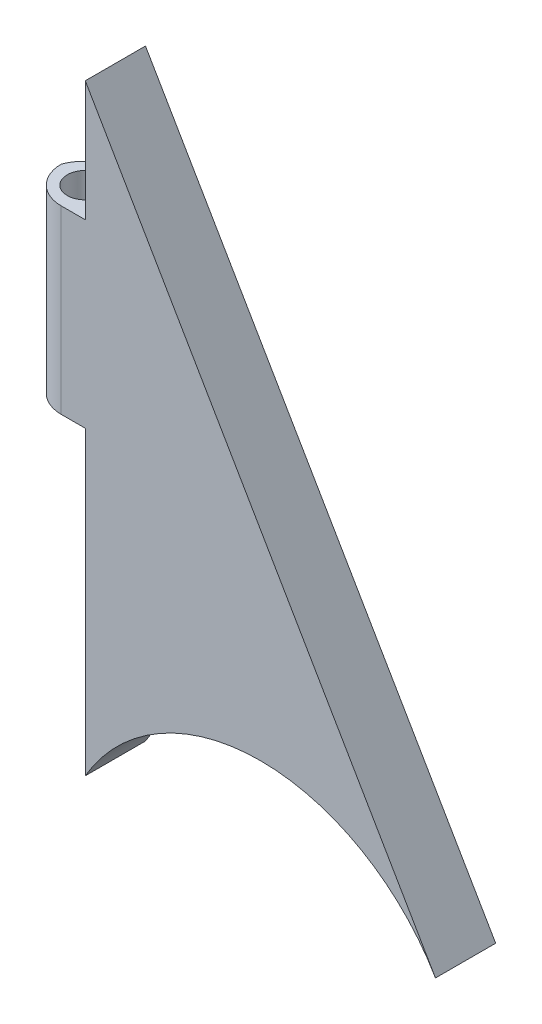
ISO-10303-21;
HEADER;
FILE_DESCRIPTION(('STEP AP214'),'2;1');
FILE_NAME('part.step','',(''),(''),'','','');
FILE_SCHEMA(('AUTOMOTIVE_DESIGN { 1 0 10303 214 1 1 1 1 }'));
ENDSEC;
DATA;
#1=APPLICATION_CONTEXT('core data for automotive mechanical design processes');
#2=APPLICATION_PROTOCOL_DEFINITION('international standard','automotive_design',2000,#1);
#3=PRODUCT_CONTEXT('',#1,'mechanical');
#4=PRODUCT('Part','Part','',(#3));
#5=PRODUCT_RELATED_PRODUCT_CATEGORY('part','',(#4));
#6=PRODUCT_DEFINITION_FORMATION('','',#4);
#7=PRODUCT_DEFINITION_CONTEXT('part definition',#1,'design');
#8=PRODUCT_DEFINITION('design','',#6,#7);
#9=PRODUCT_DEFINITION_SHAPE('','',#8);
#10=(LENGTH_UNIT() NAMED_UNIT(*) SI_UNIT(.MILLI.,.METRE.));
#11=(NAMED_UNIT(*) PLANE_ANGLE_UNIT() SI_UNIT($,.RADIAN.));
#12=(NAMED_UNIT(*) SI_UNIT($,.STERADIAN.) SOLID_ANGLE_UNIT());
#13=UNCERTAINTY_MEASURE_WITH_UNIT(LENGTH_MEASURE(1.E-05),#10,'distance_accuracy_value','');
#14=(GEOMETRIC_REPRESENTATION_CONTEXT(3) GLOBAL_UNCERTAINTY_ASSIGNED_CONTEXT((#13)) GLOBAL_UNIT_ASSIGNED_CONTEXT((#10,
#11,#12)) REPRESENTATION_CONTEXT('',''));
#15=CARTESIAN_POINT('',(0.,0.,0.));
#16=DIRECTION('',(0.,0.,1.));
#17=DIRECTION('',(1.,0.,0.));
#18=AXIS2_PLACEMENT_3D('',#15,#16,#17);
#19=CARTESIAN_POINT('',(0.,0.,-5.));
#20=DIRECTION('',(-1.,0.,0.));
#21=DIRECTION('',(0.,0.,-1.));
#22=AXIS2_PLACEMENT_3D('',#19,#20,#21);
#23=PLANE('',#22);
#24=DIRECTION('',(0.,1.,0.));
#25=VECTOR('',#24,1.);
#26=CARTESIAN_POINT('',(0.,0.,-5.));
#27=LINE('',#26,#25);
#28=CARTESIAN_POINT('',(0.,0.,-5.));
#29=VERTEX_POINT('',#28);
#30=CARTESIAN_POINT('',(0.,25.,-5.));
#31=VERTEX_POINT('',#30);
#32=EDGE_CURVE('E143',#29,#31,#27,.T.);
#33=ORIENTED_EDGE('',*,*,#32,.F.);
#34=DIRECTION('',(0.,0.,1.));
#35=VECTOR('',#34,1.);
#36=CARTESIAN_POINT('',(0.,0.,-5.));
#37=LINE('',#36,#35);
#38=CARTESIAN_POINT('',(0.,0.,0.));
#39=VERTEX_POINT('',#38);
#40=EDGE_CURVE('E148',#29,#39,#37,.T.);
#41=ORIENTED_EDGE('',*,*,#40,.T.);
#42=DIRECTION('',(0.,1.,0.));
#43=VECTOR('',#42,1.);
#44=CARTESIAN_POINT('',(0.,0.,0.));
#45=LINE('',#44,#43);
#46=CARTESIAN_POINT('',(0.,25.,0.));
#47=VERTEX_POINT('',#46);
#48=EDGE_CURVE('E120',#39,#47,#45,.T.);
#49=ORIENTED_EDGE('',*,*,#48,.T.);
#50=DIRECTION('',(0.,0.,1.));
#51=VECTOR('',#50,1.);
#52=CARTESIAN_POINT('',(0.,25.,0.));
#53=LINE('',#52,#51);
#54=EDGE_CURVE('E135',#31,#47,#53,.T.);
#55=ORIENTED_EDGE('',*,*,#54,.F.);
#56=EDGE_LOOP('',(#33,#41,#49,#55));
#57=FACE_BOUND('',#56,.T.);
#58=ADVANCED_FACE('F35',(#57),#23,.T.);
#59=CARTESIAN_POINT('',(14.5441389290883,-8.46127908754482,-5.));
#60=DIRECTION('',(0.,0.,1.));
#61=DIRECTION('',(-1.,0.,0.));
#62=AXIS2_PLACEMENT_3D('',#59,#60,#61);
#63=CYLINDRICAL_SURFACE('',#62,16.8263252371379);
#64=CARTESIAN_POINT('',(14.5441389290883,-8.46127908754482,0.));
#65=DIRECTION('',(0.,0.,1.));
#66=DIRECTION('',(1.,0.,0.));
#67=AXIS2_PLACEMENT_3D('',#64,#65,#66);
#68=CIRCLE('',#67,16.8263252371379);
#69=CARTESIAN_POINT('',(29.0882778581765,0.,0.));
#70=VERTEX_POINT('',#69);
#71=EDGE_CURVE('E121',#70,#39,#68,.T.);
#72=ORIENTED_EDGE('',*,*,#71,.T.);
#73=ORIENTED_EDGE('',*,*,#40,.F.);
#74=CARTESIAN_POINT('',(14.5441389290883,-8.46127908754482,-5.));
#75=DIRECTION('',(0.,0.,1.));
#76=DIRECTION('',(1.,0.,0.));
#77=AXIS2_PLACEMENT_3D('',#74,#75,#76);
#78=CIRCLE('',#77,16.8263252371379);
#79=CARTESIAN_POINT('',(29.0882778581765,0.,-5.));
#80=VERTEX_POINT('',#79);
#81=EDGE_CURVE('E141',#80,#29,#78,.T.);
#82=ORIENTED_EDGE('',*,*,#81,.F.);
#83=DIRECTION('',(0.,0.,1.));
#84=VECTOR('',#83,1.);
#85=CARTESIAN_POINT('',(29.0882778581765,0.,-5.));
#86=LINE('',#85,#84);
#87=EDGE_CURVE('E152',#80,#70,#86,.T.);
#88=ORIENTED_EDGE('',*,*,#87,.T.);
#89=EDGE_LOOP('',(#72,#73,#82,#88));
#90=FACE_BOUND('',#89,.T.);
#91=ADVANCED_FACE('F179',(#90),#63,.F.);
#92=CARTESIAN_POINT('',(0.,50.,-5.));
#93=DIRECTION('',(0.864368109145272,0.502859594611286,0.));
#94=DIRECTION('',(-0.502859594611286,0.864368109145272,0.));
#95=AXIS2_PLACEMENT_3D('',#92,#93,#94);
#96=PLANE('',#95);
#97=DIRECTION('',(0.502859594611286,-0.864368109145272,0.));
#98=VECTOR('',#97,1.);
#99=CARTESIAN_POINT('',(0.,50.,0.));
#100=LINE('',#99,#98);
#101=CARTESIAN_POINT('',(0.,50.,0.));
#102=VERTEX_POINT('',#101);
#103=EDGE_CURVE('E116',#102,#70,#100,.T.);
#104=ORIENTED_EDGE('',*,*,#103,.T.);
#105=ORIENTED_EDGE('',*,*,#87,.F.);
#106=DIRECTION('',(0.502859594611286,-0.864368109145272,0.));
#107=VECTOR('',#106,1.);
#108=CARTESIAN_POINT('',(0.,50.,-5.));
#109=LINE('',#108,#107);
#110=CARTESIAN_POINT('',(0.,50.,-5.));
#111=VERTEX_POINT('',#110);
#112=EDGE_CURVE('E146',#111,#80,#109,.T.);
#113=ORIENTED_EDGE('',*,*,#112,.F.);
#114=DIRECTION('',(0.,0.,1.));
#115=VECTOR('',#114,1.);
#116=CARTESIAN_POINT('',(0.,50.,-5.));
#117=LINE('',#116,#115);
#118=EDGE_CURVE('E156',#111,#102,#117,.T.);
#119=ORIENTED_EDGE('',*,*,#118,.T.);
#120=EDGE_LOOP('',(#104,#105,#113,#119));
#121=FACE_BOUND('',#120,.T.);
#122=ADVANCED_FACE('F183',(#121),#96,.T.);
#123=DIRECTION('',(0.,0.,1.));
#124=VECTOR('',#123,1.);
#125=CARTESIAN_POINT('',(0.,40.,0.));
#126=LINE('',#125,#124);
#127=CARTESIAN_POINT('',(0.,40.,-5.));
#128=VERTEX_POINT('',#127);
#129=CARTESIAN_POINT('',(0.,40.,0.));
#130=VERTEX_POINT('',#129);
#131=EDGE_CURVE('E104',#128,#130,#126,.T.);
#132=ORIENTED_EDGE('',*,*,#131,.T.);
#133=EDGE_CURVE('E113',#130,#102,#45,.T.);
#134=ORIENTED_EDGE('',*,*,#133,.T.);
#135=ORIENTED_EDGE('',*,*,#118,.F.);
#136=EDGE_CURVE('E125',#128,#111,#27,.T.);
#137=ORIENTED_EDGE('',*,*,#136,.F.);
#138=EDGE_LOOP('',(#132,#134,#135,#137));
#139=FACE_BOUND('',#138,.T.);
#140=ADVANCED_FACE('F124',(#139),#23,.T.);
#141=CARTESIAN_POINT('',(14.5441389290883,-8.46127908754482,-5.));
#142=DIRECTION('',(0.,0.,-1.));
#143=DIRECTION('',(1.,0.,0.));
#144=AXIS2_PLACEMENT_3D('',#141,#142,#143);
#145=PLANE('',#144);
#146=DIRECTION('',(1.,0.,0.));
#147=VECTOR('',#146,1.);
#148=CARTESIAN_POINT('',(0.,40.,-5.));
#149=LINE('',#148,#147);
#150=CARTESIAN_POINT('',(-2.17157287525381,40.,-5.));
#151=VERTEX_POINT('',#150);
#152=EDGE_CURVE('E110',#151,#128,#149,.T.);
#153=ORIENTED_EDGE('',*,*,#152,.T.);
#154=ORIENTED_EDGE('',*,*,#136,.T.);
#155=ORIENTED_EDGE('',*,*,#112,.T.);
#156=ORIENTED_EDGE('',*,*,#81,.T.);
#157=ORIENTED_EDGE('',*,*,#32,.T.);
#158=DIRECTION('',(1.,0.,0.));
#159=VECTOR('',#158,1.);
#160=CARTESIAN_POINT('',(0.,25.,-5.));
#161=LINE('',#160,#159);
#162=CARTESIAN_POINT('',(-2.17157287525381,25.,-5.));
#163=VERTEX_POINT('',#162);
#164=EDGE_CURVE('E126',#163,#31,#161,.T.);
#165=ORIENTED_EDGE('',*,*,#164,.F.);
#166=DIRECTION('',(0.,1.,0.));
#167=VECTOR('',#166,1.);
#168=CARTESIAN_POINT('',(-2.17157287525381,25.,-5.));
#169=LINE('',#168,#167);
#170=EDGE_CURVE('E166',#151,#163,#169,.F.);
#171=ORIENTED_EDGE('',*,*,#170,.F.);
#172=EDGE_LOOP('',(#153,#154,#155,#156,#157,#165,#171));
#173=FACE_BOUND('',#172,.T.);
#174=ADVANCED_FACE('F185',(#173),#145,.T.);
#175=CARTESIAN_POINT('',(14.5441389290883,-8.46127908754482,0.));
#176=DIRECTION('',(0.,0.,-1.));
#177=DIRECTION('',(1.,0.,0.));
#178=AXIS2_PLACEMENT_3D('',#175,#176,#177);
#179=PLANE('',#178);
#180=DIRECTION('',(-1.,0.,0.));
#181=VECTOR('',#180,1.);
#182=CARTESIAN_POINT('',(0.,25.,0.));
#183=LINE('',#182,#181);
#184=CARTESIAN_POINT('',(-2.,25.,0.));
#185=VERTEX_POINT('',#184);
#186=EDGE_CURVE('E128',#47,#185,#183,.T.);
#187=ORIENTED_EDGE('',*,*,#186,.F.);
#188=ORIENTED_EDGE('',*,*,#48,.F.);
#189=ORIENTED_EDGE('',*,*,#71,.F.);
#190=ORIENTED_EDGE('',*,*,#103,.F.);
#191=ORIENTED_EDGE('',*,*,#133,.F.);
#192=DIRECTION('',(-1.,0.,0.));
#193=VECTOR('',#192,1.);
#194=CARTESIAN_POINT('',(0.,40.,0.));
#195=LINE('',#194,#193);
#196=CARTESIAN_POINT('',(-2.,40.,0.));
#197=VERTEX_POINT('',#196);
#198=EDGE_CURVE('E98',#130,#197,#195,.T.);
#199=ORIENTED_EDGE('',*,*,#198,.T.);
#200=DIRECTION('',(0.,-1.,0.));
#201=VECTOR('',#200,1.);
#202=CARTESIAN_POINT('',(-2.,-8.46127908754482,0.));
#203=LINE('',#202,#201);
#204=EDGE_CURVE('E163',#185,#197,#203,.F.);
#205=ORIENTED_EDGE('',*,*,#204,.F.);
#206=EDGE_LOOP('',(#187,#188,#189,#190,#191,#199,#205));
#207=FACE_BOUND('',#206,.T.);
#208=ADVANCED_FACE('F114',(#207),#179,.F.);
#209=CARTESIAN_POINT('',(0.,40.,0.));
#210=DIRECTION('',(0.,-1.,0.));
#211=DIRECTION('',(0.,0.,1.));
#212=AXIS2_PLACEMENT_3D('',#209,#210,#211);
#213=PLANE('',#212);
#214=CARTESIAN_POINT('',(-2.,40.,-3.));
#215=DIRECTION('',(0.,1.,0.));
#216=DIRECTION('',(0.,0.,1.));
#217=AXIS2_PLACEMENT_3D('',#214,#215,#216);
#218=CIRCLE('',#217,3.);
#219=CARTESIAN_POINT('',(-5.,40.,-3.));
#220=VERTEX_POINT('',#219);
#221=EDGE_CURVE('E106',#197,#220,#218,.F.);
#222=ORIENTED_EDGE('',*,*,#221,.F.);
#223=ORIENTED_EDGE('',*,*,#198,.F.);
#224=ORIENTED_EDGE('',*,*,#131,.F.);
#225=ORIENTED_EDGE('',*,*,#152,.F.);
#226=CARTESIAN_POINT('',(-2.17157287525381,40.,-2.));
#227=DIRECTION('',(0.,1.,0.));
#228=DIRECTION('',(0.,0.,1.));
#229=AXIS2_PLACEMENT_3D('',#226,#227,#228);
#230=CIRCLE('',#229,3.);
#231=EDGE_CURVE('E11',#220,#151,#230,.F.);
#232=ORIENTED_EDGE('',*,*,#231,.F.);
#233=EDGE_LOOP('',(#222,#223,#224,#225,#232));
#234=FACE_BOUND('',#233,.T.);
#235=CARTESIAN_POINT('',(-2.48600518446587,40.,-2.49117230230951));
#236=DIRECTION('',(0.,-1.,0.));
#237=DIRECTION('',(0.,0.,-1.));
#238=AXIS2_PLACEMENT_3D('',#235,#236,#237);
#239=CIRCLE('',#238,1.5);
#240=CARTESIAN_POINT('',(-2.48600518446587,40.,-3.99117230230951));
#241=VERTEX_POINT('',#240);
#242=EDGE_CURVE('E138',#241,#241,#239,.T.);
#243=ORIENTED_EDGE('',*,*,#242,.T.);
#244=EDGE_LOOP('',(#243));
#245=FACE_BOUND('',#244,.T.);
#246=ADVANCED_FACE('F100',(#234,#245),#213,.F.);
#247=CARTESIAN_POINT('',(0.,25.,0.));
#248=DIRECTION('',(0.,-1.,0.));
#249=DIRECTION('',(0.,0.,1.));
#250=AXIS2_PLACEMENT_3D('',#247,#248,#249);
#251=PLANE('',#250);
#252=ORIENTED_EDGE('',*,*,#164,.T.);
#253=ORIENTED_EDGE('',*,*,#54,.T.);
#254=ORIENTED_EDGE('',*,*,#186,.T.);
#255=CARTESIAN_POINT('',(-2.,25.,-3.));
#256=DIRECTION('',(0.,1.,0.));
#257=DIRECTION('',(0.,0.,1.));
#258=AXIS2_PLACEMENT_3D('',#255,#256,#257);
#259=CIRCLE('',#258,3.);
#260=CARTESIAN_POINT('',(-5.,25.,-3.));
#261=VERTEX_POINT('',#260);
#262=EDGE_CURVE('E161',#261,#185,#259,.T.);
#263=ORIENTED_EDGE('',*,*,#262,.F.);
#264=CARTESIAN_POINT('',(-2.17157287525381,25.,-2.));
#265=DIRECTION('',(0.,1.,0.));
#266=DIRECTION('',(0.,0.,1.));
#267=AXIS2_PLACEMENT_3D('',#264,#265,#266);
#268=CIRCLE('',#267,3.);
#269=EDGE_CURVE('E43',#163,#261,#268,.T.);
#270=ORIENTED_EDGE('',*,*,#269,.F.);
#271=EDGE_LOOP('',(#252,#253,#254,#263,#270));
#272=FACE_BOUND('',#271,.T.);
#273=CARTESIAN_POINT('',(-2.48600518446587,25.,-2.49117230230951));
#274=DIRECTION('',(0.,-1.,0.));
#275=DIRECTION('',(0.,0.,-1.));
#276=AXIS2_PLACEMENT_3D('',#273,#274,#275);
#277=CIRCLE('',#276,1.5);
#278=CARTESIAN_POINT('',(-2.48600518446587,25.,-3.99117230230951));
#279=VERTEX_POINT('',#278);
#280=EDGE_CURVE('E131',#279,#279,#277,.T.);
#281=ORIENTED_EDGE('',*,*,#280,.F.);
#282=EDGE_LOOP('',(#281));
#283=FACE_BOUND('',#282,.T.);
#284=ADVANCED_FACE('F168',(#272,#283),#251,.T.);
#285=CARTESIAN_POINT('',(-2.48600518446587,40.,-2.49117230230951));
#286=DIRECTION('',(0.,-1.,0.));
#287=DIRECTION('',(0.,0.,1.));
#288=AXIS2_PLACEMENT_3D('',#285,#286,#287);
#289=CYLINDRICAL_SURFACE('',#288,1.5);
#290=ORIENTED_EDGE('',*,*,#242,.F.);
#291=EDGE_LOOP('',(#290));
#292=FACE_BOUND('',#291,.T.);
#293=ORIENTED_EDGE('',*,*,#280,.T.);
#294=EDGE_LOOP('',(#293));
#295=FACE_BOUND('',#294,.T.);
#296=ADVANCED_FACE('F202',(#292,#295),#289,.F.);
#297=CARTESIAN_POINT('',(-2.,40.,-3.));
#298=DIRECTION('',(0.,-1.,0.));
#299=DIRECTION('',(0.,0.,1.));
#300=AXIS2_PLACEMENT_3D('',#297,#298,#299);
#301=CYLINDRICAL_SURFACE('',#300,3.);
#302=ORIENTED_EDGE('',*,*,#221,.T.);
#303=DIRECTION('',(0.,-1.,0.));
#304=VECTOR('',#303,1.);
#305=CARTESIAN_POINT('',(-5.,40.,-3.));
#306=LINE('',#305,#304);
#307=EDGE_CURVE('E155',#220,#261,#306,.T.);
#308=ORIENTED_EDGE('',*,*,#307,.T.);
#309=ORIENTED_EDGE('',*,*,#262,.T.);
#310=ORIENTED_EDGE('',*,*,#204,.T.);
#311=EDGE_LOOP('',(#302,#308,#309,#310));
#312=FACE_BOUND('',#311,.T.);
#313=ADVANCED_FACE('F171',(#312),#301,.T.);
#314=CARTESIAN_POINT('',(-2.17157287525381,40.,-2.));
#315=DIRECTION('',(0.,-1.,0.));
#316=DIRECTION('',(0.,0.,1.));
#317=AXIS2_PLACEMENT_3D('',#314,#315,#316);
#318=CYLINDRICAL_SURFACE('',#317,3.);
#319=ORIENTED_EDGE('',*,*,#231,.T.);
#320=ORIENTED_EDGE('',*,*,#170,.T.);
#321=ORIENTED_EDGE('',*,*,#269,.T.);
#322=ORIENTED_EDGE('',*,*,#307,.F.);
#323=EDGE_LOOP('',(#319,#320,#321,#322));
#324=FACE_BOUND('',#323,.T.);
#325=ADVANCED_FACE('F37',(#324),#318,.T.);
#326=CLOSED_SHELL('',(#58,#91,#122,#140,#174,#208,#246,#284,#296,#313,#325));
#327=MANIFOLD_SOLID_BREP('B2',#326);
#328=ADVANCED_BREP_SHAPE_REPRESENTATION('',(#18,#327),#14);
#329=SHAPE_DEFINITION_REPRESENTATION(#9,#328);
ENDSEC;
END-ISO-10303-21;
